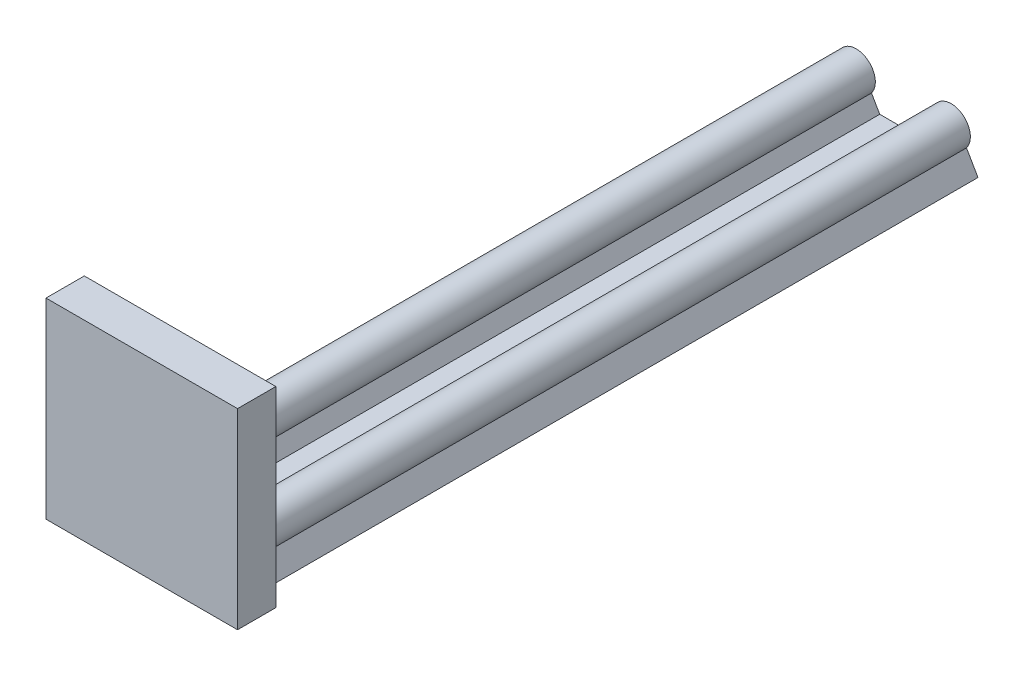
ISO-10303-21;
HEADER;
FILE_DESCRIPTION(('STEP AP214'),'2;1');
FILE_NAME('part.step','',(''),(''),'','','');
FILE_SCHEMA(('AUTOMOTIVE_DESIGN { 1 0 10303 214 1 1 1 1 }'));
ENDSEC;
DATA;
#1=APPLICATION_CONTEXT('core data for automotive mechanical design processes');
#2=APPLICATION_PROTOCOL_DEFINITION('international standard','automotive_design',2000,#1);
#3=PRODUCT_CONTEXT('',#1,'mechanical');
#4=PRODUCT('Part','Part','',(#3));
#5=PRODUCT_RELATED_PRODUCT_CATEGORY('part','',(#4));
#6=PRODUCT_DEFINITION_FORMATION('','',#4);
#7=PRODUCT_DEFINITION_CONTEXT('part definition',#1,'design');
#8=PRODUCT_DEFINITION('design','',#6,#7);
#9=PRODUCT_DEFINITION_SHAPE('','',#8);
#10=(LENGTH_UNIT() NAMED_UNIT(*) SI_UNIT(.MILLI.,.METRE.));
#11=(NAMED_UNIT(*) PLANE_ANGLE_UNIT() SI_UNIT($,.RADIAN.));
#12=(NAMED_UNIT(*) SI_UNIT($,.STERADIAN.) SOLID_ANGLE_UNIT());
#13=UNCERTAINTY_MEASURE_WITH_UNIT(LENGTH_MEASURE(1.E-05),#10,'distance_accuracy_value','');
#14=(GEOMETRIC_REPRESENTATION_CONTEXT(3) GLOBAL_UNCERTAINTY_ASSIGNED_CONTEXT((#13)) GLOBAL_UNIT_ASSIGNED_CONTEXT((#10,
#11,#12)) REPRESENTATION_CONTEXT('',''));
#15=CARTESIAN_POINT('',(0.,0.,0.));
#16=DIRECTION('',(0.,0.,1.));
#17=DIRECTION('',(1.,0.,0.));
#18=AXIS2_PLACEMENT_3D('',#15,#16,#17);
#19=CARTESIAN_POINT('',(0.,0.,220.));
#20=DIRECTION('',(0.,0.,-1.));
#21=DIRECTION('',(-1.,0.,0.));
#22=AXIS2_PLACEMENT_3D('',#19,#20,#21);
#23=CYLINDRICAL_SURFACE('',#22,5.);
#24=CARTESIAN_POINT('',(0.,0.,199.2));
#25=DIRECTION('',(0.,0.,1.));
#26=DIRECTION('',(1.,0.,0.));
#27=AXIS2_PLACEMENT_3D('',#24,#25,#26);
#28=CIRCLE('',#27,5.);
#29=CARTESIAN_POINT('',(4.,-3.,199.2));
#30=VERTEX_POINT('',#29);
#31=CARTESIAN_POINT('',(-4.,-3.,199.2));
#32=VERTEX_POINT('',#31);
#33=EDGE_CURVE('E57',#30,#32,#28,.T.);
#34=ORIENTED_EDGE('',*,*,#33,.F.);
#35=DIRECTION('',(0.,0.,-1.));
#36=VECTOR('',#35,1.);
#37=CARTESIAN_POINT('',(4.,-3.,220.));
#38=LINE('',#37,#36);
#39=CARTESIAN_POINT('',(4.,-3.,10.3));
#40=VERTEX_POINT('',#39);
#41=EDGE_CURVE('E264',#30,#40,#38,.T.);
#42=ORIENTED_EDGE('',*,*,#41,.T.);
#43=CARTESIAN_POINT('',(0.,0.,10.3));
#44=DIRECTION('',(0.,0.,-1.));
#45=DIRECTION('',(-1.,0.,0.));
#46=AXIS2_PLACEMENT_3D('',#43,#44,#45);
#47=CIRCLE('',#46,5.);
#48=CARTESIAN_POINT('',(-4.,-3.,10.3));
#49=VERTEX_POINT('',#48);
#50=EDGE_CURVE('E170',#49,#40,#47,.T.);
#51=ORIENTED_EDGE('',*,*,#50,.F.);
#52=DIRECTION('',(0.,0.,-1.));
#53=VECTOR('',#52,1.);
#54=CARTESIAN_POINT('',(-4.,-3.,220.));
#55=LINE('',#54,#53);
#56=EDGE_CURVE('E50',#32,#49,#55,.T.);
#57=ORIENTED_EDGE('',*,*,#56,.F.);
#58=EDGE_LOOP('',(#34,#42,#51,#57));
#59=FACE_BOUND('',#58,.T.);
#60=ADVANCED_FACE('F43',(#59),#23,.T.);
#61=CARTESIAN_POINT('',(-1.70096189432334,0.982050807568877,220.));
#62=DIRECTION('',(0.866025403784438,-0.5,0.));
#63=DIRECTION('',(0.5,0.866025403784439,0.));
#64=AXIS2_PLACEMENT_3D('',#61,#62,#63);
#65=PLANE('',#64);
#66=DIRECTION('',(-0.5,-0.866025403784439,0.));
#67=VECTOR('',#66,1.);
#68=CARTESIAN_POINT('',(-1.70096189432334,0.982050807568877,199.2));
#69=LINE('',#68,#67);
#70=CARTESIAN_POINT('',(-7.,-8.19615242270664,199.2));
#71=VERTEX_POINT('',#70);
#72=EDGE_CURVE('E249',#32,#71,#69,.T.);
#73=ORIENTED_EDGE('',*,*,#72,.F.);
#74=ORIENTED_EDGE('',*,*,#56,.T.);
#75=DIRECTION('',(0.5,0.866025403784439,0.));
#76=VECTOR('',#75,1.);
#77=CARTESIAN_POINT('',(-1.70096189432334,0.982050807568877,10.3));
#78=LINE('',#77,#76);
#79=CARTESIAN_POINT('',(-7.,-8.19615242270663,10.3));
#80=VERTEX_POINT('',#79);
#81=EDGE_CURVE('E167',#80,#49,#78,.T.);
#82=ORIENTED_EDGE('',*,*,#81,.F.);
#83=DIRECTION('',(0.,0.,-1.));
#84=VECTOR('',#83,1.);
#85=CARTESIAN_POINT('',(-7.,-8.19615242270663,220.));
#86=LINE('',#85,#84);
#87=EDGE_CURVE('E267',#71,#80,#86,.T.);
#88=ORIENTED_EDGE('',*,*,#87,.F.);
#89=EDGE_LOOP('',(#73,#74,#82,#88));
#90=FACE_BOUND('',#89,.T.);
#91=ADVANCED_FACE('F271',(#90),#65,.F.);
#92=CARTESIAN_POINT('',(1.70096189432334,0.982050807568877,220.));
#93=DIRECTION('',(0.866025403784438,0.5,0.));
#94=DIRECTION('',(-0.5,0.866025403784439,0.));
#95=AXIS2_PLACEMENT_3D('',#92,#93,#94);
#96=PLANE('',#95);
#97=ORIENTED_EDGE('',*,*,#41,.F.);
#98=DIRECTION('',(0.5,-0.866025403784439,0.));
#99=VECTOR('',#98,1.);
#100=CARTESIAN_POINT('',(1.70096189432334,0.982050807568877,199.2));
#101=LINE('',#100,#99);
#102=CARTESIAN_POINT('',(6.15,-6.72390923627308,199.2));
#103=VERTEX_POINT('',#102);
#104=EDGE_CURVE('E62',#30,#103,#101,.T.);
#105=ORIENTED_EDGE('',*,*,#104,.T.);
#106=DIRECTION('',(0.,0.,1.));
#107=VECTOR('',#106,1.);
#108=CARTESIAN_POINT('',(6.15,-6.72390923627308,0.));
#109=LINE('',#108,#107);
#110=CARTESIAN_POINT('',(6.15,-6.72390923627308,10.3));
#111=VERTEX_POINT('',#110);
#112=EDGE_CURVE('E261',#111,#103,#109,.T.);
#113=ORIENTED_EDGE('',*,*,#112,.F.);
#114=DIRECTION('',(0.5,-0.866025403784439,0.));
#115=VECTOR('',#114,1.);
#116=CARTESIAN_POINT('',(1.70096189432335,0.982050807568878,10.3));
#117=LINE('',#116,#115);
#118=EDGE_CURVE('E173',#40,#111,#117,.T.);
#119=ORIENTED_EDGE('',*,*,#118,.F.);
#120=EDGE_LOOP('',(#97,#105,#113,#119));
#121=FACE_BOUND('',#120,.T.);
#122=ADVANCED_FACE('F279',(#121),#96,.T.);
#123=CARTESIAN_POINT('',(6.15,-6.72390923627308,0.));
#124=DIRECTION('',(0.,1.,0.));
#125=DIRECTION('',(-1.,0.,0.));
#126=AXIS2_PLACEMENT_3D('',#123,#124,#125);
#127=PLANE('',#126);
#128=ORIENTED_EDGE('',*,*,#112,.T.);
#129=DIRECTION('',(1.,0.,0.));
#130=VECTOR('',#129,1.);
#131=CARTESIAN_POINT('',(6.15,-6.72390923627308,199.2));
#132=LINE('',#131,#130);
#133=CARTESIAN_POINT('',(18.65,-6.72390923627309,199.2));
#134=VERTEX_POINT('',#133);
#135=EDGE_CURVE('E244',#103,#134,#132,.T.);
#136=ORIENTED_EDGE('',*,*,#135,.T.);
#137=DIRECTION('',(0.,0.,1.));
#138=VECTOR('',#137,1.);
#139=CARTESIAN_POINT('',(18.65,-6.72390923627309,0.));
#140=LINE('',#139,#138);
#141=CARTESIAN_POINT('',(18.65,-6.72390923627309,10.3));
#142=VERTEX_POINT('',#141);
#143=EDGE_CURVE('E259',#142,#134,#140,.T.);
#144=ORIENTED_EDGE('',*,*,#143,.F.);
#145=DIRECTION('',(1.,0.,0.));
#146=VECTOR('',#145,1.);
#147=CARTESIAN_POINT('',(0.,-6.72390923627308,10.3));
#148=LINE('',#147,#146);
#149=EDGE_CURVE('E157',#111,#142,#148,.T.);
#150=ORIENTED_EDGE('',*,*,#149,.F.);
#151=EDGE_LOOP('',(#128,#136,#144,#150));
#152=FACE_BOUND('',#151,.T.);
#153=ADVANCED_FACE('F281',(#152),#127,.T.);
#154=CARTESIAN_POINT('',(24.8,0.,220.));
#155=DIRECTION('',(0.,0.,-1.));
#156=DIRECTION('',(-1.,0.,0.));
#157=AXIS2_PLACEMENT_3D('',#154,#155,#156);
#158=CYLINDRICAL_SURFACE('',#157,5.);
#159=DIRECTION('',(0.,0.,-1.));
#160=VECTOR('',#159,1.);
#161=CARTESIAN_POINT('',(20.8,-3.,220.));
#162=LINE('',#161,#160);
#163=CARTESIAN_POINT('',(20.8,-3.,199.2));
#164=VERTEX_POINT('',#163);
#165=CARTESIAN_POINT('',(20.8,-3.,10.3));
#166=VERTEX_POINT('',#165);
#167=EDGE_CURVE('E130',#164,#166,#162,.T.);
#168=ORIENTED_EDGE('',*,*,#167,.F.);
#169=CARTESIAN_POINT('',(24.8,0.,199.2));
#170=DIRECTION('',(0.,0.,1.));
#171=DIRECTION('',(1.,0.,0.));
#172=AXIS2_PLACEMENT_3D('',#169,#170,#171);
#173=CIRCLE('',#172,5.);
#174=CARTESIAN_POINT('',(28.8,-3.,199.2));
#175=VERTEX_POINT('',#174);
#176=EDGE_CURVE('E234',#164,#175,#173,.F.);
#177=ORIENTED_EDGE('',*,*,#176,.T.);
#178=DIRECTION('',(0.,0.,-1.));
#179=VECTOR('',#178,1.);
#180=CARTESIAN_POINT('',(28.8,-3.,220.));
#181=LINE('',#180,#179);
#182=CARTESIAN_POINT('',(28.8,-3.,10.3));
#183=VERTEX_POINT('',#182);
#184=EDGE_CURVE('E146',#175,#183,#181,.T.);
#185=ORIENTED_EDGE('',*,*,#184,.T.);
#186=CARTESIAN_POINT('',(24.8,0.,10.3));
#187=DIRECTION('',(0.,0.,-1.));
#188=DIRECTION('',(-1.,0.,0.));
#189=AXIS2_PLACEMENT_3D('',#186,#187,#188);
#190=CIRCLE('',#189,5.);
#191=EDGE_CURVE('E143',#166,#183,#190,.T.);
#192=ORIENTED_EDGE('',*,*,#191,.F.);
#193=EDGE_LOOP('',(#168,#177,#185,#192));
#194=FACE_BOUND('',#193,.T.);
#195=ADVANCED_FACE('F144',(#194),#158,.T.);
#196=CARTESIAN_POINT('',(20.8,-3.,220.));
#197=DIRECTION('',(0.866025403784439,-0.5,0.));
#198=DIRECTION('',(0.5,0.866025403784439,0.));
#199=AXIS2_PLACEMENT_3D('',#196,#197,#198);
#200=PLANE('',#199);
#201=DIRECTION('',(-0.5,-0.866025403784439,0.));
#202=VECTOR('',#201,1.);
#203=CARTESIAN_POINT('',(20.8,-3.,199.2));
#204=LINE('',#203,#202);
#205=EDGE_CURVE('E136',#164,#134,#204,.T.);
#206=ORIENTED_EDGE('',*,*,#205,.F.);
#207=ORIENTED_EDGE('',*,*,#167,.T.);
#208=DIRECTION('',(0.5,0.866025403784439,0.));
#209=VECTOR('',#208,1.);
#210=CARTESIAN_POINT('',(16.8990381056767,-9.75666419935816,10.3));
#211=LINE('',#210,#209);
#212=EDGE_CURVE('E135',#142,#166,#211,.T.);
#213=ORIENTED_EDGE('',*,*,#212,.F.);
#214=ORIENTED_EDGE('',*,*,#143,.T.);
#215=EDGE_LOOP('',(#206,#207,#213,#214));
#216=FACE_BOUND('',#215,.T.);
#217=ADVANCED_FACE('F132',(#216),#200,.F.);
#218=CARTESIAN_POINT('',(28.8,-3.,220.));
#219=DIRECTION('',(0.866025403784438,0.5,0.));
#220=DIRECTION('',(-0.5,0.866025403784438,0.));
#221=AXIS2_PLACEMENT_3D('',#218,#219,#220);
#222=PLANE('',#221);
#223=ORIENTED_EDGE('',*,*,#184,.F.);
#224=DIRECTION('',(0.5,-0.866025403784438,0.));
#225=VECTOR('',#224,1.);
#226=CARTESIAN_POINT('',(28.8,-3.,199.2));
#227=LINE('',#226,#225);
#228=CARTESIAN_POINT('',(31.8,-8.19615242270663,199.2));
#229=VERTEX_POINT('',#228);
#230=EDGE_CURVE('E11',#175,#229,#227,.T.);
#231=ORIENTED_EDGE('',*,*,#230,.T.);
#232=DIRECTION('',(0.,0.,-1.));
#233=VECTOR('',#232,1.);
#234=CARTESIAN_POINT('',(31.8,-8.19615242270663,220.));
#235=LINE('',#234,#233);
#236=CARTESIAN_POINT('',(31.8,-8.19615242270663,10.3));
#237=VERTEX_POINT('',#236);
#238=EDGE_CURVE('E139',#229,#237,#235,.T.);
#239=ORIENTED_EDGE('',*,*,#238,.T.);
#240=DIRECTION('',(0.5,-0.866025403784438,0.));
#241=VECTOR('',#240,1.);
#242=CARTESIAN_POINT('',(20.3009618943233,11.7207658144959,10.3));
#243=LINE('',#242,#241);
#244=EDGE_CURVE('E150',#183,#237,#243,.T.);
#245=ORIENTED_EDGE('',*,*,#244,.F.);
#246=EDGE_LOOP('',(#223,#231,#239,#245));
#247=FACE_BOUND('',#246,.T.);
#248=ADVANCED_FACE('F284',(#247),#222,.T.);
#249=CARTESIAN_POINT('',(0.,-8.19615242270663,220.));
#250=DIRECTION('',(0.,1.,0.));
#251=DIRECTION('',(0.,0.,1.));
#252=AXIS2_PLACEMENT_3D('',#249,#250,#251);
#253=PLANE('',#252);
#254=CARTESIAN_POINT('',(0.,-8.19615242270663,197.5));
#255=DIRECTION('',(0.,-1.,0.));
#256=DIRECTION('',(0.,0.,-1.));
#257=AXIS2_PLACEMENT_3D('',#254,#255,#256);
#258=CIRCLE('',#257,3.20000000000001);
#259=CARTESIAN_POINT('',(0.,-8.19615242270663,194.3));
#260=VERTEX_POINT('',#259);
#261=EDGE_CURVE('E193',#260,#260,#258,.T.);
#262=ORIENTED_EDGE('',*,*,#261,.F.);
#263=EDGE_LOOP('',(#262));
#264=FACE_BOUND('',#263,.T.);
#265=CARTESIAN_POINT('',(4.29197477208621E-12,-8.19615242270663,23.2));
#266=DIRECTION('',(0.,-1.,0.));
#267=DIRECTION('',(0.,0.,-1.));
#268=AXIS2_PLACEMENT_3D('',#265,#266,#267);
#269=CIRCLE('',#268,3.2);
#270=CARTESIAN_POINT('',(4.29197477208621E-12,-8.19615242270663,20.));
#271=VERTEX_POINT('',#270);
#272=EDGE_CURVE('E187',#271,#271,#269,.T.);
#273=ORIENTED_EDGE('',*,*,#272,.F.);
#274=EDGE_LOOP('',(#273));
#275=FACE_BOUND('',#274,.T.);
#276=CARTESIAN_POINT('',(24.8000000000043,-8.19615242270663,23.2000000000003));
#277=DIRECTION('',(0.,-1.,0.));
#278=DIRECTION('',(0.,0.,-1.));
#279=AXIS2_PLACEMENT_3D('',#276,#277,#278);
#280=CIRCLE('',#279,3.2);
#281=CARTESIAN_POINT('',(24.8000000000043,-8.19615242270663,20.0000000000003));
#282=VERTEX_POINT('',#281);
#283=EDGE_CURVE('E180',#282,#282,#280,.T.);
#284=ORIENTED_EDGE('',*,*,#283,.F.);
#285=EDGE_LOOP('',(#284));
#286=FACE_BOUND('',#285,.T.);
#287=CARTESIAN_POINT('',(24.8,-8.19615242270663,197.5));
#288=DIRECTION('',(0.,-1.,0.));
#289=DIRECTION('',(0.,0.,-1.));
#290=AXIS2_PLACEMENT_3D('',#287,#288,#289);
#291=CIRCLE('',#290,3.2);
#292=CARTESIAN_POINT('',(24.8,-8.19615242270663,194.3));
#293=VERTEX_POINT('',#292);
#294=EDGE_CURVE('E183',#293,#293,#291,.T.);
#295=ORIENTED_EDGE('',*,*,#294,.F.);
#296=EDGE_LOOP('',(#295));
#297=FACE_BOUND('',#296,.T.);
#298=DIRECTION('',(1.,0.,0.));
#299=VECTOR('',#298,1.);
#300=CARTESIAN_POINT('',(-7.,-8.19615242270663,209.2));
#301=LINE('',#300,#299);
#302=CARTESIAN_POINT('',(-12.6,-8.19615242270664,209.2));
#303=VERTEX_POINT('',#302);
#304=CARTESIAN_POINT('',(37.4,-8.19615242270663,209.2));
#305=VERTEX_POINT('',#304);
#306=EDGE_CURVE('E140',#303,#305,#301,.T.);
#307=ORIENTED_EDGE('',*,*,#306,.F.);
#308=DIRECTION('',(0.,0.,1.));
#309=VECTOR('',#308,1.);
#310=CARTESIAN_POINT('',(-12.6,-8.19615242270664,199.2));
#311=LINE('',#310,#309);
#312=CARTESIAN_POINT('',(-12.6,-8.19615242270664,199.2));
#313=VERTEX_POINT('',#312);
#314=EDGE_CURVE('E224',#313,#303,#311,.T.);
#315=ORIENTED_EDGE('',*,*,#314,.F.);
#316=DIRECTION('',(1.,0.,0.));
#317=VECTOR('',#316,1.);
#318=CARTESIAN_POINT('',(-12.6,-8.19615242270664,199.2));
#319=LINE('',#318,#317);
#320=EDGE_CURVE('E215',#313,#71,#319,.T.);
#321=ORIENTED_EDGE('',*,*,#320,.T.);
#322=ORIENTED_EDGE('',*,*,#87,.T.);
#323=DIRECTION('',(-1.,0.,0.));
#324=VECTOR('',#323,1.);
#325=CARTESIAN_POINT('',(0.,-8.19615242270663,10.3));
#326=LINE('',#325,#324);
#327=EDGE_CURVE('E164',#237,#80,#326,.T.);
#328=ORIENTED_EDGE('',*,*,#327,.F.);
#329=ORIENTED_EDGE('',*,*,#238,.F.);
#330=CARTESIAN_POINT('',(37.4,-8.19615242270663,199.2));
#331=VERTEX_POINT('',#330);
#332=EDGE_CURVE('E213',#229,#331,#319,.T.);
#333=ORIENTED_EDGE('',*,*,#332,.T.);
#334=DIRECTION('',(0.,0.,1.));
#335=VECTOR('',#334,1.);
#336=CARTESIAN_POINT('',(37.4,-8.19615242270663,199.2));
#337=LINE('',#336,#335);
#338=EDGE_CURVE('E237',#331,#305,#337,.T.);
#339=ORIENTED_EDGE('',*,*,#338,.T.);
#340=EDGE_LOOP('',(#307,#315,#321,#322,#328,#329,#333,#339));
#341=FACE_BOUND('',#340,.T.);
#342=ADVANCED_FACE('F287',(#264,#275,#286,#297,#341),#253,.F.);
#343=CARTESIAN_POINT('',(24.8,0.,209.2));
#344=DIRECTION('',(0.,0.,1.));
#345=DIRECTION('',(1.,0.,0.));
#346=AXIS2_PLACEMENT_3D('',#343,#344,#345);
#347=PLANE('',#346);
#348=DIRECTION('',(0.,-1.,0.));
#349=VECTOR('',#348,1.);
#350=CARTESIAN_POINT('',(-12.6,41.8038475772934,209.2));
#351=LINE('',#350,#349);
#352=CARTESIAN_POINT('',(-12.6,41.8038475772934,209.2));
#353=VERTEX_POINT('',#352);
#354=EDGE_CURVE('E207',#353,#303,#351,.T.);
#355=ORIENTED_EDGE('',*,*,#354,.T.);
#356=ORIENTED_EDGE('',*,*,#306,.T.);
#357=DIRECTION('',(0.,1.,0.));
#358=VECTOR('',#357,1.);
#359=CARTESIAN_POINT('',(37.4,41.8038475772934,209.2));
#360=LINE('',#359,#358);
#361=CARTESIAN_POINT('',(37.4,41.8038475772934,209.2));
#362=VERTEX_POINT('',#361);
#363=EDGE_CURVE('E227',#305,#362,#360,.T.);
#364=ORIENTED_EDGE('',*,*,#363,.T.);
#365=DIRECTION('',(-1.,0.,0.));
#366=VECTOR('',#365,1.);
#367=CARTESIAN_POINT('',(-12.6,41.8038475772934,209.2));
#368=LINE('',#367,#366);
#369=EDGE_CURVE('E214',#362,#353,#368,.T.);
#370=ORIENTED_EDGE('',*,*,#369,.T.);
#371=EDGE_LOOP('',(#355,#356,#364,#370));
#372=FACE_BOUND('',#371,.T.);
#373=ADVANCED_FACE('F303',(#372),#347,.T.);
#374=CARTESIAN_POINT('',(0.,0.,199.2));
#375=DIRECTION('',(0.,0.,1.));
#376=DIRECTION('',(1.,0.,0.));
#377=AXIS2_PLACEMENT_3D('',#374,#375,#376);
#378=PLANE('',#377);
#379=CARTESIAN_POINT('',(12.4,22.3038475772934,199.2));
#380=DIRECTION('',(0.,0.,-1.));
#381=DIRECTION('',(-1.,0.,0.));
#382=AXIS2_PLACEMENT_3D('',#379,#380,#381);
#383=CIRCLE('',#382,5.);
#384=CARTESIAN_POINT('',(7.4,22.3038475772934,199.2));
#385=VERTEX_POINT('',#384);
#386=EDGE_CURVE('E201',#385,#385,#383,.T.);
#387=ORIENTED_EDGE('',*,*,#386,.F.);
#388=EDGE_LOOP('',(#387));
#389=FACE_BOUND('',#388,.T.);
#390=ORIENTED_EDGE('',*,*,#33,.T.);
#391=ORIENTED_EDGE('',*,*,#72,.T.);
#392=ORIENTED_EDGE('',*,*,#320,.F.);
#393=DIRECTION('',(0.,-1.,0.));
#394=VECTOR('',#393,1.);
#395=CARTESIAN_POINT('',(-12.6,41.8038475772934,199.2));
#396=LINE('',#395,#394);
#397=CARTESIAN_POINT('',(-12.6,41.8038475772934,199.2));
#398=VERTEX_POINT('',#397);
#399=EDGE_CURVE('E210',#398,#313,#396,.T.);
#400=ORIENTED_EDGE('',*,*,#399,.F.);
#401=DIRECTION('',(-1.,0.,0.));
#402=VECTOR('',#401,1.);
#403=CARTESIAN_POINT('',(-12.6,41.8038475772934,199.2));
#404=LINE('',#403,#402);
#405=CARTESIAN_POINT('',(37.4,41.8038475772934,199.2));
#406=VERTEX_POINT('',#405);
#407=EDGE_CURVE('E221',#406,#398,#404,.T.);
#408=ORIENTED_EDGE('',*,*,#407,.F.);
#409=DIRECTION('',(0.,1.,0.));
#410=VECTOR('',#409,1.);
#411=CARTESIAN_POINT('',(37.4,41.8038475772934,199.2));
#412=LINE('',#411,#410);
#413=EDGE_CURVE('E218',#331,#406,#412,.T.);
#414=ORIENTED_EDGE('',*,*,#413,.F.);
#415=ORIENTED_EDGE('',*,*,#332,.F.);
#416=ORIENTED_EDGE('',*,*,#230,.F.);
#417=ORIENTED_EDGE('',*,*,#176,.F.);
#418=ORIENTED_EDGE('',*,*,#205,.T.);
#419=ORIENTED_EDGE('',*,*,#135,.F.);
#420=ORIENTED_EDGE('',*,*,#104,.F.);
#421=EDGE_LOOP('',(#390,#391,#392,#400,#408,#414,#415,#416,#417,#418,#419,#420));
#422=FACE_BOUND('',#421,.T.);
#423=ADVANCED_FACE('F282',(#389,#422),#378,.F.);
#424=CARTESIAN_POINT('',(-12.6,41.8038475772934,199.2));
#425=DIRECTION('',(-1.,0.,0.));
#426=DIRECTION('',(0.,-1.,0.));
#427=AXIS2_PLACEMENT_3D('',#424,#425,#426);
#428=PLANE('',#427);
#429=ORIENTED_EDGE('',*,*,#354,.F.);
#430=DIRECTION('',(0.,0.,1.));
#431=VECTOR('',#430,1.);
#432=CARTESIAN_POINT('',(-12.6,41.8038475772934,199.2));
#433=LINE('',#432,#431);
#434=EDGE_CURVE('E232',#398,#353,#433,.T.);
#435=ORIENTED_EDGE('',*,*,#434,.F.);
#436=ORIENTED_EDGE('',*,*,#399,.T.);
#437=ORIENTED_EDGE('',*,*,#314,.T.);
#438=EDGE_LOOP('',(#429,#435,#436,#437));
#439=FACE_BOUND('',#438,.T.);
#440=ADVANCED_FACE('F293',(#439),#428,.T.);
#441=CARTESIAN_POINT('',(-12.6,41.8038475772934,199.2));
#442=DIRECTION('',(0.,1.,0.));
#443=DIRECTION('',(0.,0.,1.));
#444=AXIS2_PLACEMENT_3D('',#441,#442,#443);
#445=PLANE('',#444);
#446=ORIENTED_EDGE('',*,*,#369,.F.);
#447=DIRECTION('',(0.,0.,1.));
#448=VECTOR('',#447,1.);
#449=CARTESIAN_POINT('',(37.4,41.8038475772934,199.2));
#450=LINE('',#449,#448);
#451=EDGE_CURVE('E235',#406,#362,#450,.T.);
#452=ORIENTED_EDGE('',*,*,#451,.F.);
#453=ORIENTED_EDGE('',*,*,#407,.T.);
#454=ORIENTED_EDGE('',*,*,#434,.T.);
#455=EDGE_LOOP('',(#446,#452,#453,#454));
#456=FACE_BOUND('',#455,.T.);
#457=ADVANCED_FACE('F296',(#456),#445,.T.);
#458=CARTESIAN_POINT('',(37.4,41.8038475772934,199.2));
#459=DIRECTION('',(1.,0.,0.));
#460=DIRECTION('',(0.,1.,0.));
#461=AXIS2_PLACEMENT_3D('',#458,#459,#460);
#462=PLANE('',#461);
#463=ORIENTED_EDGE('',*,*,#363,.F.);
#464=ORIENTED_EDGE('',*,*,#338,.F.);
#465=ORIENTED_EDGE('',*,*,#413,.T.);
#466=ORIENTED_EDGE('',*,*,#451,.T.);
#467=EDGE_LOOP('',(#463,#464,#465,#466));
#468=FACE_BOUND('',#467,.T.);
#469=ADVANCED_FACE('F301',(#468),#462,.T.);
#470=CARTESIAN_POINT('',(12.4,22.3038475772934,204.2));
#471=DIRECTION('',(0.,0.,-1.));
#472=DIRECTION('',(-1.,0.,0.));
#473=AXIS2_PLACEMENT_3D('',#470,#471,#472);
#474=CYLINDRICAL_SURFACE('',#473,5.);
#475=CARTESIAN_POINT('',(12.4,22.3038475772934,204.2));
#476=DIRECTION('',(0.,0.,-1.));
#477=DIRECTION('',(-1.,0.,0.));
#478=AXIS2_PLACEMENT_3D('',#475,#476,#477);
#479=CIRCLE('',#478,5.);
#480=CARTESIAN_POINT('',(7.4,22.3038475772934,204.2));
#481=VERTEX_POINT('',#480);
#482=EDGE_CURVE('E204',#481,#481,#479,.T.);
#483=ORIENTED_EDGE('',*,*,#482,.F.);
#484=EDGE_LOOP('',(#483));
#485=FACE_BOUND('',#484,.T.);
#486=ORIENTED_EDGE('',*,*,#386,.T.);
#487=EDGE_LOOP('',(#486));
#488=FACE_BOUND('',#487,.T.);
#489=ADVANCED_FACE('F501',(#485,#488),#474,.F.);
#490=CARTESIAN_POINT('',(12.4,22.3038475772934,204.2));
#491=DIRECTION('',(0.,0.,-1.));
#492=DIRECTION('',(-1.,0.,0.));
#493=AXIS2_PLACEMENT_3D('',#490,#491,#492);
#494=PLANE('',#493);
#495=ORIENTED_EDGE('',*,*,#482,.T.);
#496=EDGE_LOOP('',(#495));
#497=FACE_BOUND('',#496,.T.);
#498=ADVANCED_FACE('F509',(#497),#494,.T.);
#499=CARTESIAN_POINT('',(24.8,-3.19615242270663,197.5));
#500=DIRECTION('',(0.,-1.,0.));
#501=DIRECTION('',(0.,0.,-1.));
#502=AXIS2_PLACEMENT_3D('',#499,#500,#501);
#503=CYLINDRICAL_SURFACE('',#502,3.2);
#504=CARTESIAN_POINT('',(24.8,-3.19615242270663,197.5));
#505=DIRECTION('',(0.,-1.,0.));
#506=DIRECTION('',(0.,0.,-1.));
#507=AXIS2_PLACEMENT_3D('',#504,#505,#506);
#508=CIRCLE('',#507,3.2);
#509=CARTESIAN_POINT('',(24.8,-3.19615242270663,194.3));
#510=VERTEX_POINT('',#509);
#511=EDGE_CURVE('E198',#510,#510,#508,.T.);
#512=ORIENTED_EDGE('',*,*,#511,.F.);
#513=EDGE_LOOP('',(#512));
#514=FACE_BOUND('',#513,.T.);
#515=ORIENTED_EDGE('',*,*,#294,.T.);
#516=EDGE_LOOP('',(#515));
#517=FACE_BOUND('',#516,.T.);
#518=ADVANCED_FACE('F519',(#514,#517),#503,.F.);
#519=CARTESIAN_POINT('',(0.,-3.19615242270663,0.));
#520=DIRECTION('',(0.,-1.,0.));
#521=DIRECTION('',(0.,0.,-1.));
#522=AXIS2_PLACEMENT_3D('',#519,#520,#521);
#523=PLANE('',#522);
#524=ORIENTED_EDGE('',*,*,#511,.T.);
#525=EDGE_LOOP('',(#524));
#526=FACE_BOUND('',#525,.T.);
#527=ADVANCED_FACE('F529',(#526),#523,.T.);
#528=CARTESIAN_POINT('',(24.8000000000043,-3.19615242270663,23.2000000000003));
#529=DIRECTION('',(0.,-1.,0.));
#530=DIRECTION('',(0.,0.,-1.));
#531=AXIS2_PLACEMENT_3D('',#528,#529,#530);
#532=CYLINDRICAL_SURFACE('',#531,3.2);
#533=CARTESIAN_POINT('',(24.8000000000043,-3.19615242270663,23.2000000000003));
#534=DIRECTION('',(0.,-1.,0.));
#535=DIRECTION('',(0.,0.,-1.));
#536=AXIS2_PLACEMENT_3D('',#533,#534,#535);
#537=CIRCLE('',#536,3.2);
#538=CARTESIAN_POINT('',(24.8000000000043,-3.19615242270663,20.0000000000003));
#539=VERTEX_POINT('',#538);
#540=EDGE_CURVE('E184',#539,#539,#537,.T.);
#541=ORIENTED_EDGE('',*,*,#540,.F.);
#542=EDGE_LOOP('',(#541));
#543=FACE_BOUND('',#542,.T.);
#544=ORIENTED_EDGE('',*,*,#283,.T.);
#545=EDGE_LOOP('',(#544));
#546=FACE_BOUND('',#545,.T.);
#547=ADVANCED_FACE('F539',(#543,#546),#532,.F.);
#548=CARTESIAN_POINT('',(24.8000000000043,-3.19615242270663,23.2000000000003));
#549=DIRECTION('',(0.,-1.,0.));
#550=DIRECTION('',(0.,0.,-1.));
#551=AXIS2_PLACEMENT_3D('',#548,#549,#550);
#552=PLANE('',#551);
#553=ORIENTED_EDGE('',*,*,#540,.T.);
#554=EDGE_LOOP('',(#553));
#555=FACE_BOUND('',#554,.T.);
#556=ADVANCED_FACE('F549',(#555),#552,.T.);
#557=CARTESIAN_POINT('',(4.29197477208621E-12,-3.19615242270663,23.2));
#558=DIRECTION('',(0.,-1.,0.));
#559=DIRECTION('',(0.,0.,-1.));
#560=AXIS2_PLACEMENT_3D('',#557,#558,#559);
#561=CYLINDRICAL_SURFACE('',#560,3.2);
#562=CARTESIAN_POINT('',(4.29197477208621E-12,-3.19615242270663,23.2));
#563=DIRECTION('',(0.,-1.,0.));
#564=DIRECTION('',(0.,0.,-1.));
#565=AXIS2_PLACEMENT_3D('',#562,#563,#564);
#566=CIRCLE('',#565,3.2);
#567=CARTESIAN_POINT('',(4.29197477208621E-12,-3.19615242270663,20.));
#568=VERTEX_POINT('',#567);
#569=EDGE_CURVE('E190',#568,#568,#566,.T.);
#570=ORIENTED_EDGE('',*,*,#569,.F.);
#571=EDGE_LOOP('',(#570));
#572=FACE_BOUND('',#571,.T.);
#573=ORIENTED_EDGE('',*,*,#272,.T.);
#574=EDGE_LOOP('',(#573));
#575=FACE_BOUND('',#574,.T.);
#576=ADVANCED_FACE('F559',(#572,#575),#561,.F.);
#577=CARTESIAN_POINT('',(4.29197477208621E-12,-3.19615242270663,23.2));
#578=DIRECTION('',(0.,-1.,0.));
#579=DIRECTION('',(0.,0.,-1.));
#580=AXIS2_PLACEMENT_3D('',#577,#578,#579);
#581=PLANE('',#580);
#582=ORIENTED_EDGE('',*,*,#569,.T.);
#583=EDGE_LOOP('',(#582));
#584=FACE_BOUND('',#583,.T.);
#585=ADVANCED_FACE('F569',(#584),#581,.T.);
#586=CARTESIAN_POINT('',(0.,-3.19615242270663,197.5));
#587=DIRECTION('',(0.,-1.,0.));
#588=DIRECTION('',(0.,0.,-1.));
#589=AXIS2_PLACEMENT_3D('',#586,#587,#588);
#590=CYLINDRICAL_SURFACE('',#589,3.20000000000001);
#591=CARTESIAN_POINT('',(0.,-3.19615242270663,197.5));
#592=DIRECTION('',(0.,-1.,0.));
#593=DIRECTION('',(0.,0.,-1.));
#594=AXIS2_PLACEMENT_3D('',#591,#592,#593);
#595=CIRCLE('',#594,3.20000000000001);
#596=CARTESIAN_POINT('',(0.,-3.19615242270663,194.3));
#597=VERTEX_POINT('',#596);
#598=EDGE_CURVE('E179',#597,#597,#595,.T.);
#599=ORIENTED_EDGE('',*,*,#598,.F.);
#600=EDGE_LOOP('',(#599));
#601=FACE_BOUND('',#600,.T.);
#602=ORIENTED_EDGE('',*,*,#261,.T.);
#603=EDGE_LOOP('',(#602));
#604=FACE_BOUND('',#603,.T.);
#605=ADVANCED_FACE('F579',(#601,#604),#590,.F.);
#606=CARTESIAN_POINT('',(0.,-3.19615242270663,197.5));
#607=DIRECTION('',(0.,-1.,0.));
#608=DIRECTION('',(0.,0.,-1.));
#609=AXIS2_PLACEMENT_3D('',#606,#607,#608);
#610=PLANE('',#609);
#611=ORIENTED_EDGE('',*,*,#598,.T.);
#612=EDGE_LOOP('',(#611));
#613=FACE_BOUND('',#612,.T.);
#614=ADVANCED_FACE('F361',(#613),#610,.T.);
#615=CARTESIAN_POINT('',(0.,0.,10.3));
#616=DIRECTION('',(0.,0.,-1.));
#617=DIRECTION('',(-1.,0.,0.));
#618=AXIS2_PLACEMENT_3D('',#615,#616,#617);
#619=PLANE('',#618);
#620=CARTESIAN_POINT('',(24.8,-1.73177474406619E-13,10.3));
#621=DIRECTION('',(0.,0.,-1.));
#622=DIRECTION('',(-1.,0.,0.));
#623=AXIS2_PLACEMENT_3D('',#620,#621,#622);
#624=CIRCLE('',#623,1.5);
#625=CARTESIAN_POINT('',(23.3,-1.73177474406619E-13,10.3));
#626=VERTEX_POINT('',#625);
#627=EDGE_CURVE('E158',#626,#626,#624,.F.);
#628=ORIENTED_EDGE('',*,*,#627,.T.);
#629=EDGE_LOOP('',(#628));
#630=FACE_BOUND('',#629,.T.);
#631=ORIENTED_EDGE('',*,*,#212,.T.);
#632=ORIENTED_EDGE('',*,*,#191,.T.);
#633=ORIENTED_EDGE('',*,*,#244,.T.);
#634=ORIENTED_EDGE('',*,*,#327,.T.);
#635=ORIENTED_EDGE('',*,*,#81,.T.);
#636=ORIENTED_EDGE('',*,*,#50,.T.);
#637=ORIENTED_EDGE('',*,*,#118,.T.);
#638=ORIENTED_EDGE('',*,*,#149,.T.);
#639=EDGE_LOOP('',(#631,#632,#633,#634,#635,#636,#637,#638));
#640=FACE_BOUND('',#639,.T.);
#641=CARTESIAN_POINT('',(0.,0.,10.3));
#642=DIRECTION('',(0.,0.,-1.));
#643=DIRECTION('',(-1.,0.,0.));
#644=AXIS2_PLACEMENT_3D('',#641,#642,#643);
#645=CIRCLE('',#644,1.5);
#646=CARTESIAN_POINT('',(-1.5,0.,10.3));
#647=VERTEX_POINT('',#646);
#648=EDGE_CURVE('E176',#647,#647,#645,.F.);
#649=ORIENTED_EDGE('',*,*,#648,.T.);
#650=EDGE_LOOP('',(#649));
#651=FACE_BOUND('',#650,.T.);
#652=ADVANCED_FACE('F153',(#630,#640,#651),#619,.T.);
#653=CARTESIAN_POINT('',(24.8,-1.73177474406619E-13,17.8));
#654=DIRECTION('',(0.,0.,-1.));
#655=DIRECTION('',(-1.,0.,0.));
#656=AXIS2_PLACEMENT_3D('',#653,#654,#655);
#657=PLANE('',#656);
#658=CARTESIAN_POINT('',(24.8,-1.73177474406619E-13,17.8));
#659=DIRECTION('',(0.,0.,-1.));
#660=DIRECTION('',(-1.,0.,0.));
#661=AXIS2_PLACEMENT_3D('',#658,#659,#660);
#662=CIRCLE('',#661,1.5);
#663=CARTESIAN_POINT('',(23.3,-1.73177474406619E-13,17.8));
#664=VERTEX_POINT('',#663);
#665=EDGE_CURVE('E251',#664,#664,#662,.T.);
#666=ORIENTED_EDGE('',*,*,#665,.T.);
#667=EDGE_LOOP('',(#666));
#668=FACE_BOUND('',#667,.T.);
#669=ADVANCED_FACE('F360',(#668),#657,.T.);
#670=CARTESIAN_POINT('',(24.8,-1.73177474406619E-13,17.8));
#671=DIRECTION('',(0.,0.,-1.));
#672=DIRECTION('',(-1.,0.,0.));
#673=AXIS2_PLACEMENT_3D('',#670,#671,#672);
#674=CYLINDRICAL_SURFACE('',#673,1.5);
#675=ORIENTED_EDGE('',*,*,#665,.F.);
#676=EDGE_LOOP('',(#675));
#677=FACE_BOUND('',#676,.T.);
#678=ORIENTED_EDGE('',*,*,#627,.F.);
#679=EDGE_LOOP('',(#678));
#680=FACE_BOUND('',#679,.T.);
#681=ADVANCED_FACE('F368',(#677,#680),#674,.F.);
#682=CARTESIAN_POINT('',(0.,0.,17.8));
#683=DIRECTION('',(0.,0.,-1.));
#684=DIRECTION('',(-1.,0.,0.));
#685=AXIS2_PLACEMENT_3D('',#682,#683,#684);
#686=PLANE('',#685);
#687=CARTESIAN_POINT('',(0.,0.,17.8));
#688=DIRECTION('',(0.,0.,-1.));
#689=DIRECTION('',(-1.,0.,0.));
#690=AXIS2_PLACEMENT_3D('',#687,#688,#689);
#691=CIRCLE('',#690,1.5);
#692=CARTESIAN_POINT('',(-1.5,0.,17.8));
#693=VERTEX_POINT('',#692);
#694=EDGE_CURVE('E252',#693,#693,#691,.T.);
#695=ORIENTED_EDGE('',*,*,#694,.T.);
#696=EDGE_LOOP('',(#695));
#697=FACE_BOUND('',#696,.T.);
#698=ADVANCED_FACE('F372',(#697),#686,.T.);
#699=CARTESIAN_POINT('',(0.,0.,17.8));
#700=DIRECTION('',(0.,0.,-1.));
#701=DIRECTION('',(-1.,0.,0.));
#702=AXIS2_PLACEMENT_3D('',#699,#700,#701);
#703=CYLINDRICAL_SURFACE('',#702,1.5);
#704=ORIENTED_EDGE('',*,*,#694,.F.);
#705=EDGE_LOOP('',(#704));
#706=FACE_BOUND('',#705,.T.);
#707=ORIENTED_EDGE('',*,*,#648,.F.);
#708=EDGE_LOOP('',(#707));
#709=FACE_BOUND('',#708,.T.);
#710=ADVANCED_FACE('F379',(#706,#709),#703,.F.);
#711=CLOSED_SHELL('',(#60,#91,#122,#153,#195,#217,#248,#342,#373,#423,#440,#457,#469,#489,#498,
#518,#527,#547,#556,#576,#585,#605,#614,#652,#669,#681,#698,#710));
#712=MANIFOLD_SOLID_BREP('B2',#711);
#713=ADVANCED_BREP_SHAPE_REPRESENTATION('',(#18,#712),#14);
#714=SHAPE_DEFINITION_REPRESENTATION(#9,#713);
ENDSEC;
END-ISO-10303-21;
